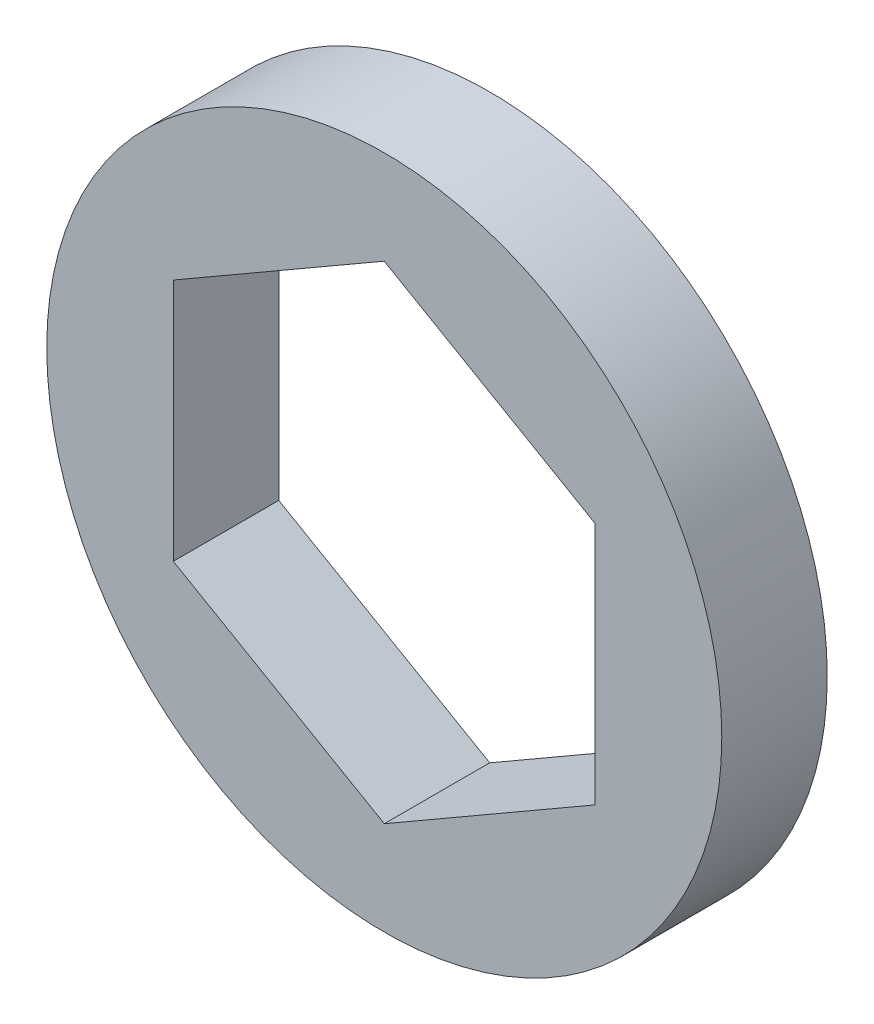
ISO-10303-21;
HEADER;
FILE_DESCRIPTION(('STEP AP214'),'2;1');
FILE_NAME('part.step','',(''),(''),'','','');
FILE_SCHEMA(('AUTOMOTIVE_DESIGN { 1 0 10303 214 1 1 1 1 }'));
ENDSEC;
DATA;
#1=APPLICATION_CONTEXT('core data for automotive mechanical design processes');
#2=APPLICATION_PROTOCOL_DEFINITION('international standard','automotive_design',2000,#1);
#3=PRODUCT_CONTEXT('',#1,'mechanical');
#4=PRODUCT('Part','Part','',(#3));
#5=PRODUCT_RELATED_PRODUCT_CATEGORY('part','',(#4));
#6=PRODUCT_DEFINITION_FORMATION('','',#4);
#7=PRODUCT_DEFINITION_CONTEXT('part definition',#1,'design');
#8=PRODUCT_DEFINITION('design','',#6,#7);
#9=PRODUCT_DEFINITION_SHAPE('','',#8);
#10=(LENGTH_UNIT() NAMED_UNIT(*) SI_UNIT(.MILLI.,.METRE.));
#11=(NAMED_UNIT(*) PLANE_ANGLE_UNIT() SI_UNIT($,.RADIAN.));
#12=(NAMED_UNIT(*) SI_UNIT($,.STERADIAN.) SOLID_ANGLE_UNIT());
#13=UNCERTAINTY_MEASURE_WITH_UNIT(LENGTH_MEASURE(1.E-05),#10,'distance_accuracy_value','');
#14=(GEOMETRIC_REPRESENTATION_CONTEXT(3) GLOBAL_UNCERTAINTY_ASSIGNED_CONTEXT((#13)) GLOBAL_UNIT_ASSIGNED_CONTEXT((#10,
#11,#12)) REPRESENTATION_CONTEXT('',''));
#15=CARTESIAN_POINT('',(0.,0.,0.));
#16=DIRECTION('',(0.,0.,1.));
#17=DIRECTION('',(1.,0.,0.));
#18=AXIS2_PLACEMENT_3D('',#15,#16,#17);
#19=CARTESIAN_POINT('',(0.,0.,3.175));
#20=DIRECTION('',(0.,0.,1.));
#21=DIRECTION('',(1.,0.,0.));
#22=AXIS2_PLACEMENT_3D('',#19,#20,#21);
#23=PLANE('',#22);
#24=CARTESIAN_POINT('',(0.,0.,3.175));
#25=DIRECTION('',(0.,0.,1.));
#26=DIRECTION('',(1.,0.,0.));
#27=AXIS2_PLACEMENT_3D('',#24,#25,#26);
#28=CIRCLE('',#27,10.16);
#29=CARTESIAN_POINT('',(10.16,0.,3.175));
#30=VERTEX_POINT('',#29);
#31=EDGE_CURVE('E11',#30,#30,#28,.T.);
#32=ORIENTED_EDGE('',*,*,#31,.T.);
#33=EDGE_LOOP('',(#32));
#34=FACE_BOUND('',#33,.T.);
#35=DIRECTION('',(-0.866025403784439,-0.5,0.));
#36=VECTOR('',#35,1.);
#37=CARTESIAN_POINT('',(0.,7.33234841870825,3.175));
#38=LINE('',#37,#36);
#39=CARTESIAN_POINT('',(0.,7.33234841870825,3.175));
#40=VERTEX_POINT('',#39);
#41=CARTESIAN_POINT('',(-6.35,3.66617420935413,3.175));
#42=VERTEX_POINT('',#41);
#43=EDGE_CURVE('E102',#40,#42,#38,.T.);
#44=ORIENTED_EDGE('',*,*,#43,.F.);
#45=DIRECTION('',(-0.866025403784438,0.5,0.));
#46=VECTOR('',#45,1.);
#47=CARTESIAN_POINT('',(6.35,3.66617420935413,3.175));
#48=LINE('',#47,#46);
#49=CARTESIAN_POINT('',(6.35,3.66617420935413,3.175));
#50=VERTEX_POINT('',#49);
#51=EDGE_CURVE('E93',#50,#40,#48,.T.);
#52=ORIENTED_EDGE('',*,*,#51,.F.);
#53=DIRECTION('',(0.,1.,0.));
#54=VECTOR('',#53,1.);
#55=CARTESIAN_POINT('',(6.35,-3.66617420935412,3.175));
#56=LINE('',#55,#54);
#57=CARTESIAN_POINT('',(6.35,-3.66617420935412,3.175));
#58=VERTEX_POINT('',#57);
#59=EDGE_CURVE('E127',#58,#50,#56,.T.);
#60=ORIENTED_EDGE('',*,*,#59,.F.);
#61=DIRECTION('',(0.866025403784438,0.5,0.));
#62=VECTOR('',#61,1.);
#63=CARTESIAN_POINT('',(0.,-7.33234841870825,3.175));
#64=LINE('',#63,#62);
#65=CARTESIAN_POINT('',(0.,-7.33234841870825,3.175));
#66=VERTEX_POINT('',#65);
#67=EDGE_CURVE('E124',#66,#58,#64,.T.);
#68=ORIENTED_EDGE('',*,*,#67,.F.);
#69=DIRECTION('',(0.866025403784438,-0.5,0.));
#70=VECTOR('',#69,1.);
#71=CARTESIAN_POINT('',(-6.35,-3.66617420935412,3.175));
#72=LINE('',#71,#70);
#73=CARTESIAN_POINT('',(-6.35,-3.66617420935412,3.175));
#74=VERTEX_POINT('',#73);
#75=EDGE_CURVE('E119',#74,#66,#72,.T.);
#76=ORIENTED_EDGE('',*,*,#75,.F.);
#77=DIRECTION('',(0.,-1.,0.));
#78=VECTOR('',#77,1.);
#79=CARTESIAN_POINT('',(-6.35,3.66617420935413,3.175));
#80=LINE('',#79,#78);
#81=EDGE_CURVE('E115',#42,#74,#80,.T.);
#82=ORIENTED_EDGE('',*,*,#81,.F.);
#83=EDGE_LOOP('',(#44,#52,#60,#68,#76,#82));
#84=FACE_BOUND('',#83,.T.);
#85=ADVANCED_FACE('F39',(#34,#84),#23,.T.);
#86=CARTESIAN_POINT('',(0.,0.,0.));
#87=DIRECTION('',(0.,0.,1.));
#88=DIRECTION('',(1.,0.,0.));
#89=AXIS2_PLACEMENT_3D('',#86,#87,#88);
#90=PLANE('',#89);
#91=CARTESIAN_POINT('',(0.,0.,0.));
#92=DIRECTION('',(0.,0.,1.));
#93=DIRECTION('',(1.,0.,0.));
#94=AXIS2_PLACEMENT_3D('',#91,#92,#93);
#95=CIRCLE('',#94,10.16);
#96=CARTESIAN_POINT('',(10.16,0.,0.));
#97=VERTEX_POINT('',#96);
#98=EDGE_CURVE('E43',#97,#97,#95,.T.);
#99=ORIENTED_EDGE('',*,*,#98,.F.);
#100=EDGE_LOOP('',(#99));
#101=FACE_BOUND('',#100,.T.);
#102=DIRECTION('',(-0.866025403784438,0.5,0.));
#103=VECTOR('',#102,1.);
#104=CARTESIAN_POINT('',(6.35,3.66617420935413,0.));
#105=LINE('',#104,#103);
#106=CARTESIAN_POINT('',(6.35,3.66617420935413,0.));
#107=VERTEX_POINT('',#106);
#108=CARTESIAN_POINT('',(0.,7.33234841870825,0.));
#109=VERTEX_POINT('',#108);
#110=EDGE_CURVE('E63',#107,#109,#105,.T.);
#111=ORIENTED_EDGE('',*,*,#110,.T.);
#112=DIRECTION('',(-0.866025403784439,-0.5,0.));
#113=VECTOR('',#112,1.);
#114=CARTESIAN_POINT('',(0.,7.33234841870825,0.));
#115=LINE('',#114,#113);
#116=CARTESIAN_POINT('',(-6.35,3.66617420935413,0.));
#117=VERTEX_POINT('',#116);
#118=EDGE_CURVE('E109',#109,#117,#115,.T.);
#119=ORIENTED_EDGE('',*,*,#118,.T.);
#120=DIRECTION('',(0.,-1.,0.));
#121=VECTOR('',#120,1.);
#122=CARTESIAN_POINT('',(-6.35,3.66617420935413,0.));
#123=LINE('',#122,#121);
#124=CARTESIAN_POINT('',(-6.35,-3.66617420935412,0.));
#125=VERTEX_POINT('',#124);
#126=EDGE_CURVE('E134',#117,#125,#123,.T.);
#127=ORIENTED_EDGE('',*,*,#126,.T.);
#128=DIRECTION('',(0.866025403784438,-0.5,0.));
#129=VECTOR('',#128,1.);
#130=CARTESIAN_POINT('',(-6.35,-3.66617420935412,0.));
#131=LINE('',#130,#129);
#132=CARTESIAN_POINT('',(0.,-7.33234841870825,0.));
#133=VERTEX_POINT('',#132);
#134=EDGE_CURVE('E138',#125,#133,#131,.T.);
#135=ORIENTED_EDGE('',*,*,#134,.T.);
#136=DIRECTION('',(0.866025403784438,0.5,0.));
#137=VECTOR('',#136,1.);
#138=CARTESIAN_POINT('',(0.,-7.33234841870825,0.));
#139=LINE('',#138,#137);
#140=CARTESIAN_POINT('',(6.35,-3.66617420935412,0.));
#141=VERTEX_POINT('',#140);
#142=EDGE_CURVE('E142',#133,#141,#139,.T.);
#143=ORIENTED_EDGE('',*,*,#142,.T.);
#144=DIRECTION('',(0.,1.,0.));
#145=VECTOR('',#144,1.);
#146=CARTESIAN_POINT('',(6.35,-3.66617420935412,0.));
#147=LINE('',#146,#145);
#148=EDGE_CURVE('E103',#141,#107,#147,.T.);
#149=ORIENTED_EDGE('',*,*,#148,.T.);
#150=EDGE_LOOP('',(#111,#119,#127,#135,#143,#149));
#151=FACE_BOUND('',#150,.T.);
#152=ADVANCED_FACE('F166',(#101,#151),#90,.F.);
#153=CARTESIAN_POINT('',(0.,0.,3.175));
#154=DIRECTION('',(0.,0.,-1.));
#155=DIRECTION('',(-1.,0.,0.));
#156=AXIS2_PLACEMENT_3D('',#153,#154,#155);
#157=CYLINDRICAL_SURFACE('',#156,10.16);
#158=ORIENTED_EDGE('',*,*,#31,.F.);
#159=EDGE_LOOP('',(#158));
#160=FACE_BOUND('',#159,.T.);
#161=ORIENTED_EDGE('',*,*,#98,.T.);
#162=EDGE_LOOP('',(#161));
#163=FACE_BOUND('',#162,.T.);
#164=ADVANCED_FACE('F41',(#160,#163),#157,.T.);
#165=CARTESIAN_POINT('',(6.35,3.66617420935413,3.175));
#166=DIRECTION('',(-0.5,-0.866025403784438,0.));
#167=DIRECTION('',(0.866025403784439,-0.5,0.));
#168=AXIS2_PLACEMENT_3D('',#165,#166,#167);
#169=PLANE('',#168);
#170=ORIENTED_EDGE('',*,*,#110,.F.);
#171=DIRECTION('',(0.,0.,-1.));
#172=VECTOR('',#171,1.);
#173=CARTESIAN_POINT('',(6.35,3.66617420935413,3.175));
#174=LINE('',#173,#172);
#175=EDGE_CURVE('E97',#50,#107,#174,.T.);
#176=ORIENTED_EDGE('',*,*,#175,.F.);
#177=ORIENTED_EDGE('',*,*,#51,.T.);
#178=DIRECTION('',(0.,0.,-1.));
#179=VECTOR('',#178,1.);
#180=CARTESIAN_POINT('',(0.,7.33234841870825,3.175));
#181=LINE('',#180,#179);
#182=EDGE_CURVE('E96',#40,#109,#181,.T.);
#183=ORIENTED_EDGE('',*,*,#182,.T.);
#184=EDGE_LOOP('',(#170,#176,#177,#183));
#185=FACE_BOUND('',#184,.T.);
#186=ADVANCED_FACE('F95',(#185),#169,.T.);
#187=CARTESIAN_POINT('',(0.,7.33234841870825,3.175));
#188=DIRECTION('',(0.5,-0.866025403784439,0.));
#189=DIRECTION('',(0.866025403784439,0.5,0.));
#190=AXIS2_PLACEMENT_3D('',#187,#188,#189);
#191=PLANE('',#190);
#192=ORIENTED_EDGE('',*,*,#118,.F.);
#193=ORIENTED_EDGE('',*,*,#182,.F.);
#194=ORIENTED_EDGE('',*,*,#43,.T.);
#195=DIRECTION('',(0.,0.,-1.));
#196=VECTOR('',#195,1.);
#197=CARTESIAN_POINT('',(-6.35,3.66617420935413,3.175));
#198=LINE('',#197,#196);
#199=EDGE_CURVE('E111',#42,#117,#198,.T.);
#200=ORIENTED_EDGE('',*,*,#199,.T.);
#201=EDGE_LOOP('',(#192,#193,#194,#200));
#202=FACE_BOUND('',#201,.T.);
#203=ADVANCED_FACE('F106',(#202),#191,.T.);
#204=CARTESIAN_POINT('',(-6.35,3.66617420935413,3.175));
#205=DIRECTION('',(1.,0.,0.));
#206=DIRECTION('',(0.,1.,0.));
#207=AXIS2_PLACEMENT_3D('',#204,#205,#206);
#208=PLANE('',#207);
#209=ORIENTED_EDGE('',*,*,#126,.F.);
#210=ORIENTED_EDGE('',*,*,#199,.F.);
#211=ORIENTED_EDGE('',*,*,#81,.T.);
#212=DIRECTION('',(0.,0.,-1.));
#213=VECTOR('',#212,1.);
#214=CARTESIAN_POINT('',(-6.35,-3.66617420935412,3.175));
#215=LINE('',#214,#213);
#216=EDGE_CURVE('E156',#74,#125,#215,.T.);
#217=ORIENTED_EDGE('',*,*,#216,.T.);
#218=EDGE_LOOP('',(#209,#210,#211,#217));
#219=FACE_BOUND('',#218,.T.);
#220=ADVANCED_FACE('F162',(#219),#208,.T.);
#221=CARTESIAN_POINT('',(-6.35,-3.66617420935412,3.175));
#222=DIRECTION('',(0.5,0.866025403784438,0.));
#223=DIRECTION('',(-0.866025403784439,0.5,0.));
#224=AXIS2_PLACEMENT_3D('',#221,#222,#223);
#225=PLANE('',#224);
#226=ORIENTED_EDGE('',*,*,#134,.F.);
#227=ORIENTED_EDGE('',*,*,#216,.F.);
#228=ORIENTED_EDGE('',*,*,#75,.T.);
#229=DIRECTION('',(0.,0.,-1.));
#230=VECTOR('',#229,1.);
#231=CARTESIAN_POINT('',(0.,-7.33234841870825,3.175));
#232=LINE('',#231,#230);
#233=EDGE_CURVE('E153',#66,#133,#232,.T.);
#234=ORIENTED_EDGE('',*,*,#233,.T.);
#235=EDGE_LOOP('',(#226,#227,#228,#234));
#236=FACE_BOUND('',#235,.T.);
#237=ADVANCED_FACE('F174',(#236),#225,.T.);
#238=CARTESIAN_POINT('',(0.,-7.33234841870825,3.175));
#239=DIRECTION('',(-0.5,0.866025403784438,0.));
#240=DIRECTION('',(-0.866025403784439,-0.5,0.));
#241=AXIS2_PLACEMENT_3D('',#238,#239,#240);
#242=PLANE('',#241);
#243=ORIENTED_EDGE('',*,*,#142,.F.);
#244=ORIENTED_EDGE('',*,*,#233,.F.);
#245=ORIENTED_EDGE('',*,*,#67,.T.);
#246=DIRECTION('',(0.,0.,-1.));
#247=VECTOR('',#246,1.);
#248=CARTESIAN_POINT('',(6.35,-3.66617420935412,3.175));
#249=LINE('',#248,#247);
#250=EDGE_CURVE('E55',#58,#141,#249,.T.);
#251=ORIENTED_EDGE('',*,*,#250,.T.);
#252=EDGE_LOOP('',(#243,#244,#245,#251));
#253=FACE_BOUND('',#252,.T.);
#254=ADVANCED_FACE('F172',(#253),#242,.T.);
#255=CARTESIAN_POINT('',(6.35,-3.66617420935412,3.175));
#256=DIRECTION('',(-1.,0.,0.));
#257=DIRECTION('',(0.,-1.,0.));
#258=AXIS2_PLACEMENT_3D('',#255,#256,#257);
#259=PLANE('',#258);
#260=ORIENTED_EDGE('',*,*,#148,.F.);
#261=ORIENTED_EDGE('',*,*,#250,.F.);
#262=ORIENTED_EDGE('',*,*,#59,.T.);
#263=ORIENTED_EDGE('',*,*,#175,.T.);
#264=EDGE_LOOP('',(#260,#261,#262,#263));
#265=FACE_BOUND('',#264,.T.);
#266=ADVANCED_FACE('F168',(#265),#259,.T.);
#267=CLOSED_SHELL('',(#85,#152,#164,#186,#203,#220,#237,#254,#266));
#268=MANIFOLD_SOLID_BREP('B2',#267);
#269=ADVANCED_BREP_SHAPE_REPRESENTATION('',(#18,#268),#14);
#270=SHAPE_DEFINITION_REPRESENTATION(#9,#269);
ENDSEC;
END-ISO-10303-21;
